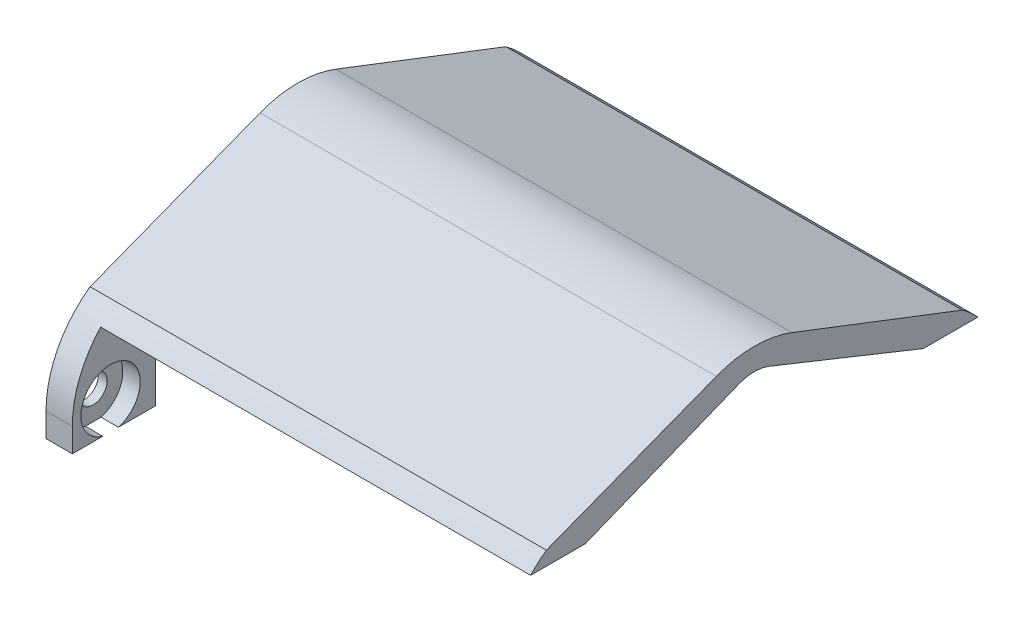
ISO-10303-21;
HEADER;
FILE_DESCRIPTION(('STEP AP214'),'2;1');
FILE_NAME('part.step','',(''),(''),'','','');
FILE_SCHEMA(('AUTOMOTIVE_DESIGN { 1 0 10303 214 1 1 1 1 }'));
ENDSEC;
DATA;
#1=APPLICATION_CONTEXT('core data for automotive mechanical design processes');
#2=APPLICATION_PROTOCOL_DEFINITION('international standard','automotive_design',2000,#1);
#3=PRODUCT_CONTEXT('',#1,'mechanical');
#4=PRODUCT('Part','Part','',(#3));
#5=PRODUCT_RELATED_PRODUCT_CATEGORY('part','',(#4));
#6=PRODUCT_DEFINITION_FORMATION('','',#4);
#7=PRODUCT_DEFINITION_CONTEXT('part definition',#1,'design');
#8=PRODUCT_DEFINITION('design','',#6,#7);
#9=PRODUCT_DEFINITION_SHAPE('','',#8);
#10=(LENGTH_UNIT() NAMED_UNIT(*) SI_UNIT(.MILLI.,.METRE.));
#11=(NAMED_UNIT(*) PLANE_ANGLE_UNIT() SI_UNIT($,.RADIAN.));
#12=(NAMED_UNIT(*) SI_UNIT($,.STERADIAN.) SOLID_ANGLE_UNIT());
#13=UNCERTAINTY_MEASURE_WITH_UNIT(LENGTH_MEASURE(1.E-05),#10,'distance_accuracy_value','');
#14=(GEOMETRIC_REPRESENTATION_CONTEXT(3) GLOBAL_UNCERTAINTY_ASSIGNED_CONTEXT((#13)) GLOBAL_UNIT_ASSIGNED_CONTEXT((#10,
#11,#12)) REPRESENTATION_CONTEXT('',''));
#15=CARTESIAN_POINT('',(0.,0.,0.));
#16=DIRECTION('',(0.,0.,1.));
#17=DIRECTION('',(1.,0.,0.));
#18=AXIS2_PLACEMENT_3D('',#15,#16,#17);
#19=CARTESIAN_POINT('',(110.,0.,0.));
#20=DIRECTION('',(0.,0.,1.));
#21=DIRECTION('',(1.,0.,0.));
#22=AXIS2_PLACEMENT_3D('',#19,#20,#21);
#23=PLANE('',#22);
#24=DIRECTION('',(-1.,0.,0.));
#25=VECTOR('',#24,1.);
#26=CARTESIAN_POINT('',(110.,0.,0.));
#27=LINE('',#26,#25);
#28=CARTESIAN_POINT('',(6.34999999999999,0.,0.));
#29=VERTEX_POINT('',#28);
#30=CARTESIAN_POINT('',(0.,0.,0.));
#31=VERTEX_POINT('',#30);
#32=EDGE_CURVE('E241',#29,#31,#27,.T.);
#33=ORIENTED_EDGE('',*,*,#32,.F.);
#34=DIRECTION('',(0.,-1.,0.));
#35=VECTOR('',#34,1.);
#36=CARTESIAN_POINT('',(6.34999999999999,23.0488587595201,0.));
#37=LINE('',#36,#35);
#38=CARTESIAN_POINT('',(6.34999999999999,5.73152923092014,0.));
#39=VERTEX_POINT('',#38);
#40=EDGE_CURVE('E312',#39,#29,#37,.T.);
#41=ORIENTED_EDGE('',*,*,#40,.F.);
#42=DIRECTION('',(-1.,0.,0.));
#43=VECTOR('',#42,1.);
#44=CARTESIAN_POINT('',(0.,5.73152923092014,0.));
#45=LINE('',#44,#43);
#46=CARTESIAN_POINT('',(0.,5.73152923092014,0.));
#47=VERTEX_POINT('',#46);
#48=EDGE_CURVE('E223',#39,#47,#45,.T.);
#49=ORIENTED_EDGE('',*,*,#48,.T.);
#50=DIRECTION('',(0.,1.,0.));
#51=VECTOR('',#50,1.);
#52=CARTESIAN_POINT('',(0.,0.,0.));
#53=LINE('',#52,#51);
#54=EDGE_CURVE('E292',#31,#47,#53,.T.);
#55=ORIENTED_EDGE('',*,*,#54,.F.);
#56=EDGE_LOOP('',(#33,#41,#49,#55));
#57=FACE_BOUND('',#56,.T.);
#58=ADVANCED_FACE('F33',(#57),#23,.T.);
#59=CARTESIAN_POINT('',(110.,0.,0.));
#60=DIRECTION('',(0.,1.,0.));
#61=DIRECTION('',(0.,0.,1.));
#62=AXIS2_PLACEMENT_3D('',#59,#60,#61);
#63=PLANE('',#62);
#64=DIRECTION('',(0.,0.,1.));
#65=VECTOR('',#64,1.);
#66=CARTESIAN_POINT('',(2.15899999999999,0.,0.));
#67=LINE('',#66,#65);
#68=CARTESIAN_POINT('',(2.15899999999999,0.,-11.0970781813428));
#69=VERTEX_POINT('',#68);
#70=CARTESIAN_POINT('',(2.15899999999999,0.,-7.32292181865722));
#71=VERTEX_POINT('',#70);
#72=EDGE_CURVE('E41',#69,#71,#67,.T.);
#73=ORIENTED_EDGE('',*,*,#72,.T.);
#74=DIRECTION('',(1.,0.,0.));
#75=VECTOR('',#74,1.);
#76=CARTESIAN_POINT('',(6.34999999999999,0.,-7.32292181865722));
#77=LINE('',#76,#75);
#78=CARTESIAN_POINT('',(6.34999999999999,0.,-7.32292181865722));
#79=VERTEX_POINT('',#78);
#80=EDGE_CURVE('E11',#71,#79,#77,.T.);
#81=ORIENTED_EDGE('',*,*,#80,.T.);
#82=DIRECTION('',(0.,0.,-1.));
#83=VECTOR('',#82,1.);
#84=CARTESIAN_POINT('',(6.34999999999999,0.,-20.));
#85=LINE('',#84,#83);
#86=EDGE_CURVE('E295',#29,#79,#85,.T.);
#87=ORIENTED_EDGE('',*,*,#86,.F.);
#88=ORIENTED_EDGE('',*,*,#32,.T.);
#89=DIRECTION('',(0.,0.,-1.));
#90=VECTOR('',#89,1.);
#91=CARTESIAN_POINT('',(0.,0.,0.));
#92=LINE('',#91,#90);
#93=CARTESIAN_POINT('',(0.,0.,-20.));
#94=VERTEX_POINT('',#93);
#95=EDGE_CURVE('E264',#31,#94,#92,.T.);
#96=ORIENTED_EDGE('',*,*,#95,.T.);
#97=DIRECTION('',(-1.,0.,0.));
#98=VECTOR('',#97,1.);
#99=CARTESIAN_POINT('',(110.,0.,-20.));
#100=LINE('',#99,#98);
#101=CARTESIAN_POINT('',(6.34999999999999,0.,-20.));
#102=VERTEX_POINT('',#101);
#103=EDGE_CURVE('E261',#102,#94,#100,.T.);
#104=ORIENTED_EDGE('',*,*,#103,.F.);
#105=CARTESIAN_POINT('',(6.34999999999999,0.,-11.0970781813428));
#106=VERTEX_POINT('',#105);
#107=EDGE_CURVE('E311',#106,#102,#85,.T.);
#108=ORIENTED_EDGE('',*,*,#107,.F.);
#109=DIRECTION('',(1.,0.,0.));
#110=VECTOR('',#109,1.);
#111=CARTESIAN_POINT('',(6.34999999999999,0.,-11.0970781813428));
#112=LINE('',#111,#110);
#113=EDGE_CURVE('E187',#106,#69,#112,.F.);
#114=ORIENTED_EDGE('',*,*,#113,.T.);
#115=EDGE_LOOP('',(#73,#81,#87,#88,#96,#104,#108,#114));
#116=FACE_BOUND('',#115,.T.);
#117=ADVANCED_FACE('F185',(#116),#63,.F.);
#118=CARTESIAN_POINT('',(110.,0.,-20.));
#119=DIRECTION('',(0.,0.,1.));
#120=DIRECTION('',(1.,0.,0.));
#121=AXIS2_PLACEMENT_3D('',#118,#119,#120);
#122=PLANE('',#121);
#123=DIRECTION('',(0.,1.,0.));
#124=VECTOR('',#123,1.);
#125=CARTESIAN_POINT('',(6.34999999999999,0.,-20.));
#126=LINE('',#125,#124);
#127=CARTESIAN_POINT('',(6.34999999999999,23.0488587595201,-20.));
#128=VERTEX_POINT('',#127);
#129=EDGE_CURVE('E308',#102,#128,#126,.T.);
#130=ORIENTED_EDGE('',*,*,#129,.F.);
#131=ORIENTED_EDGE('',*,*,#103,.T.);
#132=DIRECTION('',(0.,1.,0.));
#133=VECTOR('',#132,1.);
#134=CARTESIAN_POINT('',(0.,0.,-20.));
#135=LINE('',#134,#133);
#136=CARTESIAN_POINT('',(0.,23.0488587595201,-20.));
#137=VERTEX_POINT('',#136);
#138=EDGE_CURVE('E268',#94,#137,#135,.T.);
#139=ORIENTED_EDGE('',*,*,#138,.T.);
#140=DIRECTION('',(-1.,0.,0.));
#141=VECTOR('',#140,1.);
#142=CARTESIAN_POINT('',(110.,23.0488587595201,-20.));
#143=LINE('',#142,#141);
#144=EDGE_CURVE('E257',#128,#137,#143,.T.);
#145=ORIENTED_EDGE('',*,*,#144,.F.);
#146=EDGE_LOOP('',(#130,#131,#139,#145));
#147=FACE_BOUND('',#146,.T.);
#148=ADVANCED_FACE('F365',(#147),#122,.F.);
#149=CARTESIAN_POINT('',(110.,23.0488587595201,-20.));
#150=DIRECTION('',(0.,0.928334047087366,0.371747087437673));
#151=DIRECTION('',(0.,-0.371747087437673,0.928334047087366));
#152=AXIS2_PLACEMENT_3D('',#149,#150,#151);
#153=PLANE('',#152);
#154=DIRECTION('',(0.,0.371747087437673,-0.928334047087366));
#155=VECTOR('',#154,1.);
#156=CARTESIAN_POINT('',(0.,23.0488587595201,-20.));
#157=LINE('',#156,#155);
#158=CARTESIAN_POINT('',(0.,37.8775437443954,-57.0304801575639));
#159=VERTEX_POINT('',#158);
#160=EDGE_CURVE('E271',#137,#159,#157,.T.);
#161=ORIENTED_EDGE('',*,*,#160,.T.);
#162=DIRECTION('',(-1.,0.,0.));
#163=VECTOR('',#162,1.);
#164=CARTESIAN_POINT('',(110.,37.8775437443954,-57.0304801575639));
#165=LINE('',#164,#163);
#166=CARTESIAN_POINT('',(110.,37.8775437443954,-57.0304801575639));
#167=VERTEX_POINT('',#166);
#168=EDGE_CURVE('E213',#159,#167,#165,.F.);
#169=ORIENTED_EDGE('',*,*,#168,.T.);
#170=DIRECTION('',(0.,0.371747087437673,-0.928334047087366));
#171=VECTOR('',#170,1.);
#172=CARTESIAN_POINT('',(110.,23.0488587595201,-20.));
#173=LINE('',#172,#171);
#174=CARTESIAN_POINT('',(110.,23.0488587595201,-20.));
#175=VERTEX_POINT('',#174);
#176=EDGE_CURVE('E246',#175,#167,#173,.T.);
#177=ORIENTED_EDGE('',*,*,#176,.F.);
#178=EDGE_CURVE('E258',#175,#128,#143,.T.);
#179=ORIENTED_EDGE('',*,*,#178,.T.);
#180=ORIENTED_EDGE('',*,*,#144,.T.);
#181=EDGE_LOOP('',(#161,#169,#177,#179,#180));
#182=FACE_BOUND('',#181,.T.);
#183=ADVANCED_FACE('F407',(#182),#153,.F.);
#184=CARTESIAN_POINT('',(110.,23.0488587595201,-101.495902063881));
#185=DIRECTION('',(0.,-0.928334047087366,0.371747087437673));
#186=DIRECTION('',(0.,-0.371747087437673,-0.928334047087366));
#187=AXIS2_PLACEMENT_3D('',#184,#185,#186);
#188=PLANE('',#187);
#189=DIRECTION('',(0.,0.371747087437673,0.928334047087366));
#190=VECTOR('',#189,1.);
#191=CARTESIAN_POINT('',(110.,23.0488587595201,-101.495902063881));
#192=LINE('',#191,#190);
#193=CARTESIAN_POINT('',(110.,23.0488587595201,-101.495902063881));
#194=VERTEX_POINT('',#193);
#195=CARTESIAN_POINT('',(110.,37.8775437443954,-64.4654219063173));
#196=VERTEX_POINT('',#195);
#197=EDGE_CURVE('E298',#194,#196,#192,.T.);
#198=ORIENTED_EDGE('',*,*,#197,.T.);
#199=DIRECTION('',(-1.,0.,0.));
#200=VECTOR('',#199,1.);
#201=CARTESIAN_POINT('',(110.,37.8775437443954,-64.4654219063173));
#202=LINE('',#201,#200);
#203=CARTESIAN_POINT('',(0.,37.8775437443954,-64.4654219063173));
#204=VERTEX_POINT('',#203);
#205=EDGE_CURVE('E215',#196,#204,#202,.T.);
#206=ORIENTED_EDGE('',*,*,#205,.T.);
#207=DIRECTION('',(0.,0.371747087437673,0.928334047087366));
#208=VECTOR('',#207,1.);
#209=CARTESIAN_POINT('',(0.,23.0488587595201,-101.495902063881));
#210=LINE('',#209,#208);
#211=CARTESIAN_POINT('',(0.,23.0488587595201,-101.495902063881));
#212=VERTEX_POINT('',#211);
#213=EDGE_CURVE('E274',#212,#204,#210,.T.);
#214=ORIENTED_EDGE('',*,*,#213,.F.);
#215=DIRECTION('',(-1.,0.,0.));
#216=VECTOR('',#215,1.);
#217=CARTESIAN_POINT('',(110.,23.0488587595201,-101.495902063881));
#218=LINE('',#217,#216);
#219=CARTESIAN_POINT('',(6.34999999999999,23.0488587595201,-101.495902063881));
#220=VERTEX_POINT('',#219);
#221=EDGE_CURVE('E253',#220,#212,#218,.T.);
#222=ORIENTED_EDGE('',*,*,#221,.F.);
#223=EDGE_CURVE('E254',#194,#220,#218,.T.);
#224=ORIENTED_EDGE('',*,*,#223,.F.);
#225=EDGE_LOOP('',(#198,#206,#214,#222,#224));
#226=FACE_BOUND('',#225,.T.);
#227=ADVANCED_FACE('F414',(#226),#188,.T.);
#228=CARTESIAN_POINT('',(110.,23.0488587595201,-101.495902063881));
#229=DIRECTION('',(0.,0.,-1.));
#230=DIRECTION('',(-1.,0.,0.));
#231=AXIS2_PLACEMENT_3D('',#228,#229,#230);
#232=PLANE('',#231);
#233=DIRECTION('',(-1.,0.,0.));
#234=VECTOR('',#233,1.);
#235=CARTESIAN_POINT('',(110.,0.,-101.495902063881));
#236=LINE('',#235,#234);
#237=CARTESIAN_POINT('',(6.34999999999999,0.,-101.495902063881));
#238=VERTEX_POINT('',#237);
#239=CARTESIAN_POINT('',(0.,0.,-101.495902063881));
#240=VERTEX_POINT('',#239);
#241=EDGE_CURVE('E251',#238,#240,#236,.T.);
#242=ORIENTED_EDGE('',*,*,#241,.F.);
#243=DIRECTION('',(0.,-1.,0.));
#244=VECTOR('',#243,1.);
#245=CARTESIAN_POINT('',(6.34999999999999,0.,-101.495902063881));
#246=LINE('',#245,#244);
#247=EDGE_CURVE('E320',#220,#238,#246,.T.);
#248=ORIENTED_EDGE('',*,*,#247,.F.);
#249=ORIENTED_EDGE('',*,*,#221,.T.);
#250=DIRECTION('',(0.,-1.,0.));
#251=VECTOR('',#250,1.);
#252=CARTESIAN_POINT('',(0.,23.0488587595201,-101.495902063881));
#253=LINE('',#252,#251);
#254=EDGE_CURVE('E277',#212,#240,#253,.T.);
#255=ORIENTED_EDGE('',*,*,#254,.T.);
#256=EDGE_LOOP('',(#242,#248,#249,#255));
#257=FACE_BOUND('',#256,.T.);
#258=ADVANCED_FACE('F424',(#257),#232,.F.);
#259=CARTESIAN_POINT('',(110.,0.,-101.495902063881));
#260=DIRECTION('',(0.,1.,0.));
#261=DIRECTION('',(0.,0.,1.));
#262=AXIS2_PLACEMENT_3D('',#259,#260,#261);
#263=PLANE('',#262);
#264=DIRECTION('',(0.,0.,1.));
#265=VECTOR('',#264,1.);
#266=CARTESIAN_POINT('',(2.15899999999999,0.,-101.495902063881));
#267=LINE('',#266,#265);
#268=CARTESIAN_POINT('',(2.15899999999999,0.,-114.172980245224));
#269=VERTEX_POINT('',#268);
#270=CARTESIAN_POINT('',(2.15899999999999,0.,-110.398823882538));
#271=VERTEX_POINT('',#270);
#272=EDGE_CURVE('E193',#269,#271,#267,.T.);
#273=ORIENTED_EDGE('',*,*,#272,.T.);
#274=DIRECTION('',(1.,0.,0.));
#275=VECTOR('',#274,1.);
#276=CARTESIAN_POINT('',(6.34999999999999,0.,-110.398823882538));
#277=LINE('',#276,#275);
#278=CARTESIAN_POINT('',(6.34999999999999,0.,-110.398823882538));
#279=VERTEX_POINT('',#278);
#280=EDGE_CURVE('E188',#271,#279,#277,.T.);
#281=ORIENTED_EDGE('',*,*,#280,.T.);
#282=DIRECTION('',(0.,0.,-1.));
#283=VECTOR('',#282,1.);
#284=CARTESIAN_POINT('',(6.34999999999999,0.,-121.495902063881));
#285=LINE('',#284,#283);
#286=EDGE_CURVE('E325',#238,#279,#285,.T.);
#287=ORIENTED_EDGE('',*,*,#286,.F.);
#288=ORIENTED_EDGE('',*,*,#241,.T.);
#289=DIRECTION('',(0.,0.,-1.));
#290=VECTOR('',#289,1.);
#291=CARTESIAN_POINT('',(0.,0.,-101.495902063881));
#292=LINE('',#291,#290);
#293=CARTESIAN_POINT('',(0.,0.,-121.495902063881));
#294=VERTEX_POINT('',#293);
#295=EDGE_CURVE('E280',#240,#294,#292,.T.);
#296=ORIENTED_EDGE('',*,*,#295,.T.);
#297=DIRECTION('',(-1.,0.,0.));
#298=VECTOR('',#297,1.);
#299=CARTESIAN_POINT('',(110.,0.,-121.495902063881));
#300=LINE('',#299,#298);
#301=CARTESIAN_POINT('',(6.34999999999999,0.,-121.495902063881));
#302=VERTEX_POINT('',#301);
#303=EDGE_CURVE('E249',#302,#294,#300,.T.);
#304=ORIENTED_EDGE('',*,*,#303,.F.);
#305=CARTESIAN_POINT('',(6.34999999999999,0.,-114.172980245224));
#306=VERTEX_POINT('',#305);
#307=EDGE_CURVE('E328',#306,#302,#285,.T.);
#308=ORIENTED_EDGE('',*,*,#307,.F.);
#309=DIRECTION('',(1.,0.,0.));
#310=VECTOR('',#309,1.);
#311=CARTESIAN_POINT('',(6.34999999999999,0.,-114.172980245224));
#312=LINE('',#311,#310);
#313=EDGE_CURVE('E196',#306,#269,#312,.F.);
#314=ORIENTED_EDGE('',*,*,#313,.T.);
#315=EDGE_LOOP('',(#273,#281,#287,#288,#296,#304,#308,#314));
#316=FACE_BOUND('',#315,.T.);
#317=ADVANCED_FACE('F431',(#316),#263,.F.);
#318=CARTESIAN_POINT('',(110.,0.,-121.495902063881));
#319=DIRECTION('',(0.,0.,1.));
#320=DIRECTION('',(1.,0.,0.));
#321=AXIS2_PLACEMENT_3D('',#318,#319,#320);
#322=PLANE('',#321);
#323=DIRECTION('',(-1.,0.,0.));
#324=VECTOR('',#323,1.);
#325=CARTESIAN_POINT('',(110.,5.73152923092011,-121.495902063881));
#326=LINE('',#325,#324);
#327=CARTESIAN_POINT('',(0.,5.7315292309201,-121.495902063881));
#328=VERTEX_POINT('',#327);
#329=CARTESIAN_POINT('',(6.34999999999999,5.73152923092011,-121.495902063881));
#330=VERTEX_POINT('',#329);
#331=EDGE_CURVE('E232',#328,#330,#326,.F.);
#332=ORIENTED_EDGE('',*,*,#331,.T.);
#333=DIRECTION('',(0.,1.,0.));
#334=VECTOR('',#333,1.);
#335=CARTESIAN_POINT('',(6.34999999999999,23.0488587595201,-121.495902063881));
#336=LINE('',#335,#334);
#337=EDGE_CURVE('E323',#302,#330,#336,.T.);
#338=ORIENTED_EDGE('',*,*,#337,.F.);
#339=ORIENTED_EDGE('',*,*,#303,.T.);
#340=DIRECTION('',(0.,1.,0.));
#341=VECTOR('',#340,1.);
#342=CARTESIAN_POINT('',(0.,0.,-121.495902063881));
#343=LINE('',#342,#341);
#344=EDGE_CURVE('E283',#294,#328,#343,.T.);
#345=ORIENTED_EDGE('',*,*,#344,.T.);
#346=EDGE_LOOP('',(#332,#338,#339,#345));
#347=FACE_BOUND('',#346,.T.);
#348=ADVANCED_FACE('F439',(#347),#322,.F.);
#349=CARTESIAN_POINT('',(110.,26.3956793465189,-110.865902063881));
#350=DIRECTION('',(0.,-0.933068535772419,0.359698634347581));
#351=DIRECTION('',(0.,-0.359698634347581,-0.933068535772419));
#352=AXIS2_PLACEMENT_3D('',#349,#350,#351);
#353=PLANE('',#352);
#354=DIRECTION('',(0.,0.359698634347581,0.933068535772419));
#355=VECTOR('',#354,1.);
#356=CARTESIAN_POINT('',(0.,26.3956793465189,-110.865902063881));
#357=LINE('',#356,#355);
#358=CARTESIAN_POINT('',(0.,26.3956793465189,-110.865902063881));
#359=VERTEX_POINT('',#358);
#360=CARTESIAN_POINT('',(0.,42.1941197027533,-69.8842963443692));
#361=VERTEX_POINT('',#360);
#362=EDGE_CURVE('E286',#359,#361,#357,.T.);
#363=ORIENTED_EDGE('',*,*,#362,.T.);
#364=DIRECTION('',(-1.,0.,0.));
#365=VECTOR('',#364,1.);
#366=CARTESIAN_POINT('',(110.,42.1941197027533,-69.8842963443692));
#367=LINE('',#366,#365);
#368=CARTESIAN_POINT('',(110.,42.1941197027533,-69.8842963443692));
#369=VERTEX_POINT('',#368);
#370=EDGE_CURVE('E218',#361,#369,#367,.F.);
#371=ORIENTED_EDGE('',*,*,#370,.T.);
#372=DIRECTION('',(0.,0.359698634347581,0.933068535772419));
#373=VECTOR('',#372,1.);
#374=CARTESIAN_POINT('',(110.,26.3956793465189,-110.865902063881));
#375=LINE('',#374,#373);
#376=CARTESIAN_POINT('',(110.,26.3956793465189,-110.865902063881));
#377=VERTEX_POINT('',#376);
#378=EDGE_CURVE('E301',#377,#369,#375,.T.);
#379=ORIENTED_EDGE('',*,*,#378,.F.);
#380=DIRECTION('',(-1.,0.,0.));
#381=VECTOR('',#380,1.);
#382=CARTESIAN_POINT('',(110.,26.3956793465189,-110.865902063881));
#383=LINE('',#382,#381);
#384=EDGE_CURVE('E245',#377,#359,#383,.T.);
#385=ORIENTED_EDGE('',*,*,#384,.T.);
#386=EDGE_LOOP('',(#363,#371,#379,#385));
#387=FACE_BOUND('',#386,.T.);
#388=ADVANCED_FACE('F448',(#387),#353,.F.);
#389=CARTESIAN_POINT('',(110.,26.3956793465189,-10.63));
#390=DIRECTION('',(0.,0.933068535772419,0.359698634347581));
#391=DIRECTION('',(0.,-0.359698634347581,0.933068535772419));
#392=AXIS2_PLACEMENT_3D('',#389,#390,#391);
#393=PLANE('',#392);
#394=DIRECTION('',(0.,0.359698634347581,-0.933068535772419));
#395=VECTOR('',#394,1.);
#396=CARTESIAN_POINT('',(110.,26.3956793465189,-10.63));
#397=LINE('',#396,#395);
#398=CARTESIAN_POINT('',(110.,26.3956793465189,-10.63));
#399=VERTEX_POINT('',#398);
#400=CARTESIAN_POINT('',(110.,42.1941197027533,-51.611605719512));
#401=VERTEX_POINT('',#400);
#402=EDGE_CURVE('E267',#399,#401,#397,.T.);
#403=ORIENTED_EDGE('',*,*,#402,.T.);
#404=DIRECTION('',(-1.,0.,0.));
#405=VECTOR('',#404,1.);
#406=CARTESIAN_POINT('',(0.,42.1941197027533,-51.611605719512));
#407=LINE('',#406,#405);
#408=CARTESIAN_POINT('',(0.,42.1941197027533,-51.611605719512));
#409=VERTEX_POINT('',#408);
#410=EDGE_CURVE('E220',#401,#409,#407,.T.);
#411=ORIENTED_EDGE('',*,*,#410,.T.);
#412=DIRECTION('',(0.,0.359698634347581,-0.933068535772419));
#413=VECTOR('',#412,1.);
#414=CARTESIAN_POINT('',(0.,26.3956793465189,-10.63));
#415=LINE('',#414,#413);
#416=CARTESIAN_POINT('',(0.,26.3956793465189,-10.63));
#417=VERTEX_POINT('',#416);
#418=EDGE_CURVE('E289',#417,#409,#415,.T.);
#419=ORIENTED_EDGE('',*,*,#418,.F.);
#420=DIRECTION('',(-1.,0.,0.));
#421=VECTOR('',#420,1.);
#422=CARTESIAN_POINT('',(110.,26.3956793465189,-10.63));
#423=LINE('',#422,#421);
#424=EDGE_CURVE('E242',#399,#417,#423,.T.);
#425=ORIENTED_EDGE('',*,*,#424,.F.);
#426=EDGE_LOOP('',(#403,#411,#419,#425));
#427=FACE_BOUND('',#426,.T.);
#428=ADVANCED_FACE('F370',(#427),#393,.T.);
#429=CARTESIAN_POINT('',(110.,0.,0.));
#430=DIRECTION('',(-1.,0.,0.));
#431=DIRECTION('',(0.,0.,1.));
#432=AXIS2_PLACEMENT_3D('',#429,#430,#431);
#433=PLANE('',#432);
#434=ORIENTED_EDGE('',*,*,#197,.F.);
#435=DIRECTION('',(0.,0.,1.));
#436=VECTOR('',#435,1.);
#437=CARTESIAN_POINT('',(110.,23.0488587595201,-101.495902063881));
#438=LINE('',#437,#436);
#439=CARTESIAN_POINT('',(110.,23.0488587595201,-114.677347056074));
#440=VERTEX_POINT('',#439);
#441=EDGE_CURVE('E318',#440,#194,#438,.T.);
#442=ORIENTED_EDGE('',*,*,#441,.F.);
#443=CARTESIAN_POINT('',(110.,5.73152923092011,-96.0959020638812));
#444=DIRECTION('',(-1.,0.,0.));
#445=DIRECTION('',(0.,0.,1.));
#446=AXIS2_PLACEMENT_3D('',#443,#444,#445);
#447=CIRCLE('',#446,25.4);
#448=EDGE_CURVE('E225',#440,#377,#447,.F.);
#449=ORIENTED_EDGE('',*,*,#448,.T.);
#450=ORIENTED_EDGE('',*,*,#378,.T.);
#451=CARTESIAN_POINT('',(110.,18.4941788941338,-60.7479510319406));
#452=DIRECTION('',(-1.,0.,0.));
#453=DIRECTION('',(0.,0.,1.));
#454=AXIS2_PLACEMENT_3D('',#451,#452,#453);
#455=CIRCLE('',#454,25.4);
#456=EDGE_CURVE('E230',#369,#401,#455,.F.);
#457=ORIENTED_EDGE('',*,*,#456,.T.);
#458=ORIENTED_EDGE('',*,*,#402,.F.);
#459=CARTESIAN_POINT('',(110.,5.73152923092014,-25.4));
#460=DIRECTION('',(-1.,0.,0.));
#461=DIRECTION('',(0.,0.,1.));
#462=AXIS2_PLACEMENT_3D('',#459,#460,#461);
#463=CIRCLE('',#462,25.4);
#464=CARTESIAN_POINT('',(110.,23.0488587595201,-6.81855500780738));
#465=VERTEX_POINT('',#464);
#466=EDGE_CURVE('E227',#399,#465,#463,.F.);
#467=ORIENTED_EDGE('',*,*,#466,.T.);
#468=DIRECTION('',(0.,0.,1.));
#469=VECTOR('',#468,1.);
#470=CARTESIAN_POINT('',(110.,23.0488587595201,-20.));
#471=LINE('',#470,#469);
#472=EDGE_CURVE('E306',#175,#465,#471,.T.);
#473=ORIENTED_EDGE('',*,*,#472,.F.);
#474=ORIENTED_EDGE('',*,*,#176,.T.);
#475=CARTESIAN_POINT('',(110.,28.5942032735217,-60.7479510319406));
#476=DIRECTION('',(-1.,0.,0.));
#477=DIRECTION('',(0.,0.,1.));
#478=AXIS2_PLACEMENT_3D('',#475,#476,#477);
#479=CIRCLE('',#478,10.);
#480=EDGE_CURVE('E209',#167,#196,#479,.T.);
#481=ORIENTED_EDGE('',*,*,#480,.T.);
#482=EDGE_LOOP('',(#434,#442,#449,#450,#457,#458,#467,#473,#474,#481));
#483=FACE_BOUND('',#482,.T.);
#484=ADVANCED_FACE('F394',(#483),#433,.F.);
#485=CARTESIAN_POINT('',(0.,0.,0.));
#486=DIRECTION('',(-1.,0.,0.));
#487=DIRECTION('',(0.,0.,1.));
#488=AXIS2_PLACEMENT_3D('',#485,#486,#487);
#489=PLANE('',#488);
#490=CARTESIAN_POINT('',(0.,6.89,-9.21));
#491=DIRECTION('',(1.,0.,0.));
#492=DIRECTION('',(0.,0.,-1.));
#493=AXIS2_PLACEMENT_3D('',#490,#491,#492);
#494=CIRCLE('',#493,3.3782);
#495=CARTESIAN_POINT('',(0.,6.89,-12.5882));
#496=VERTEX_POINT('',#495);
#497=EDGE_CURVE('E338',#496,#496,#494,.T.);
#498=ORIENTED_EDGE('',*,*,#497,.T.);
#499=EDGE_LOOP('',(#498));
#500=FACE_BOUND('',#499,.T.);
#501=CARTESIAN_POINT('',(0.,6.89,-112.285902063881));
#502=DIRECTION('',(1.,0.,0.));
#503=DIRECTION('',(0.,0.,-1.));
#504=AXIS2_PLACEMENT_3D('',#501,#502,#503);
#505=CIRCLE('',#504,3.3782);
#506=CARTESIAN_POINT('',(0.,6.89,-115.664102063881));
#507=VERTEX_POINT('',#506);
#508=EDGE_CURVE('E321',#507,#507,#505,.T.);
#509=ORIENTED_EDGE('',*,*,#508,.T.);
#510=EDGE_LOOP('',(#509));
#511=FACE_BOUND('',#510,.T.);
#512=ORIENTED_EDGE('',*,*,#362,.F.);
#513=CARTESIAN_POINT('',(0.,5.73152923092011,-96.0959020638812));
#514=DIRECTION('',(-1.,0.,0.));
#515=DIRECTION('',(0.,0.,1.));
#516=AXIS2_PLACEMENT_3D('',#513,#514,#515);
#517=CIRCLE('',#516,25.4);
#518=EDGE_CURVE('E235',#359,#328,#517,.T.);
#519=ORIENTED_EDGE('',*,*,#518,.T.);
#520=ORIENTED_EDGE('',*,*,#344,.F.);
#521=ORIENTED_EDGE('',*,*,#295,.F.);
#522=ORIENTED_EDGE('',*,*,#254,.F.);
#523=ORIENTED_EDGE('',*,*,#213,.T.);
#524=CARTESIAN_POINT('',(0.,28.5942032735217,-60.7479510319406));
#525=DIRECTION('',(-1.,0.,0.));
#526=DIRECTION('',(0.,0.,1.));
#527=AXIS2_PLACEMENT_3D('',#524,#525,#526);
#528=CIRCLE('',#527,10.);
#529=EDGE_CURVE('E211',#204,#159,#528,.F.);
#530=ORIENTED_EDGE('',*,*,#529,.T.);
#531=ORIENTED_EDGE('',*,*,#160,.F.);
#532=ORIENTED_EDGE('',*,*,#138,.F.);
#533=ORIENTED_EDGE('',*,*,#95,.F.);
#534=ORIENTED_EDGE('',*,*,#54,.T.);
#535=CARTESIAN_POINT('',(0.,5.73152923092014,-25.4));
#536=DIRECTION('',(-1.,0.,0.));
#537=DIRECTION('',(0.,0.,1.));
#538=AXIS2_PLACEMENT_3D('',#535,#536,#537);
#539=CIRCLE('',#538,25.4);
#540=EDGE_CURVE('E237',#47,#417,#539,.T.);
#541=ORIENTED_EDGE('',*,*,#540,.T.);
#542=ORIENTED_EDGE('',*,*,#418,.T.);
#543=CARTESIAN_POINT('',(0.,18.4941788941338,-60.7479510319406));
#544=DIRECTION('',(-1.,0.,0.));
#545=DIRECTION('',(0.,0.,1.));
#546=AXIS2_PLACEMENT_3D('',#543,#544,#545);
#547=CIRCLE('',#546,25.4);
#548=EDGE_CURVE('E239',#409,#361,#547,.T.);
#549=ORIENTED_EDGE('',*,*,#548,.T.);
#550=EDGE_LOOP('',(#512,#519,#520,#521,#522,#523,#530,#531,#532,#533,#534,#541,#542,#549));
#551=FACE_BOUND('',#550,.T.);
#552=ADVANCED_FACE('F376',(#500,#511,#551),#489,.T.);
#553=CARTESIAN_POINT('',(110.,5.73152923092011,-96.0959020638812));
#554=DIRECTION('',(-1.,0.,0.));
#555=DIRECTION('',(0.,0.,1.));
#556=AXIS2_PLACEMENT_3D('',#553,#554,#555);
#557=CYLINDRICAL_SURFACE('',#556,25.4);
#558=DIRECTION('',(-1.,0.,0.));
#559=VECTOR('',#558,1.);
#560=CARTESIAN_POINT('',(110.,23.0488587595201,-114.677347056074));
#561=LINE('',#560,#559);
#562=CARTESIAN_POINT('',(6.34999999999999,23.0488587595201,-114.677347056074));
#563=VERTEX_POINT('',#562);
#564=EDGE_CURVE('E199',#563,#440,#561,.F.);
#565=ORIENTED_EDGE('',*,*,#564,.F.);
#566=CARTESIAN_POINT('',(6.34999999999999,5.73152923092011,-96.0959020638812));
#567=DIRECTION('',(-1.,0.,0.));
#568=DIRECTION('',(0.,0.,1.));
#569=AXIS2_PLACEMENT_3D('',#566,#567,#568);
#570=CIRCLE('',#569,25.4);
#571=EDGE_CURVE('E201',#330,#563,#570,.F.);
#572=ORIENTED_EDGE('',*,*,#571,.F.);
#573=ORIENTED_EDGE('',*,*,#331,.F.);
#574=ORIENTED_EDGE('',*,*,#518,.F.);
#575=ORIENTED_EDGE('',*,*,#384,.F.);
#576=ORIENTED_EDGE('',*,*,#448,.F.);
#577=EDGE_LOOP('',(#565,#572,#573,#574,#575,#576));
#578=FACE_BOUND('',#577,.T.);
#579=ADVANCED_FACE('F372',(#578),#557,.T.);
#580=CARTESIAN_POINT('',(110.,5.73152923092014,-25.4));
#581=DIRECTION('',(1.,0.,0.));
#582=DIRECTION('',(0.,0.,-1.));
#583=AXIS2_PLACEMENT_3D('',#580,#581,#582);
#584=CYLINDRICAL_SURFACE('',#583,25.4);
#585=DIRECTION('',(1.,0.,0.));
#586=VECTOR('',#585,1.);
#587=CARTESIAN_POINT('',(110.,23.0488587595201,-6.81855500780738));
#588=LINE('',#587,#586);
#589=CARTESIAN_POINT('',(6.34999999999999,23.0488587595201,-6.81855500780738));
#590=VERTEX_POINT('',#589);
#591=EDGE_CURVE('E203',#465,#590,#588,.F.);
#592=ORIENTED_EDGE('',*,*,#591,.F.);
#593=ORIENTED_EDGE('',*,*,#466,.F.);
#594=ORIENTED_EDGE('',*,*,#424,.T.);
#595=ORIENTED_EDGE('',*,*,#540,.F.);
#596=ORIENTED_EDGE('',*,*,#48,.F.);
#597=CARTESIAN_POINT('',(6.34999999999999,5.73152923092014,-25.4));
#598=DIRECTION('',(1.,0.,0.));
#599=DIRECTION('',(0.,0.,-1.));
#600=AXIS2_PLACEMENT_3D('',#597,#598,#599);
#601=CIRCLE('',#600,25.4);
#602=EDGE_CURVE('E206',#39,#590,#601,.F.);
#603=ORIENTED_EDGE('',*,*,#602,.T.);
#604=EDGE_LOOP('',(#592,#593,#594,#595,#596,#603));
#605=FACE_BOUND('',#604,.T.);
#606=ADVANCED_FACE('F375',(#605),#584,.T.);
#607=CARTESIAN_POINT('',(110.,18.4941788941338,-60.7479510319406));
#608=DIRECTION('',(1.,0.,0.));
#609=DIRECTION('',(0.,0.,-1.));
#610=AXIS2_PLACEMENT_3D('',#607,#608,#609);
#611=CYLINDRICAL_SURFACE('',#610,25.4);
#612=ORIENTED_EDGE('',*,*,#456,.F.);
#613=ORIENTED_EDGE('',*,*,#370,.F.);
#614=ORIENTED_EDGE('',*,*,#548,.F.);
#615=ORIENTED_EDGE('',*,*,#410,.F.);
#616=EDGE_LOOP('',(#612,#613,#614,#615));
#617=FACE_BOUND('',#616,.T.);
#618=ADVANCED_FACE('F379',(#617),#611,.T.);
#619=CARTESIAN_POINT('',(110.,28.5942032735217,-60.7479510319406));
#620=DIRECTION('',(-1.,0.,0.));
#621=DIRECTION('',(0.,0.,1.));
#622=AXIS2_PLACEMENT_3D('',#619,#620,#621);
#623=CYLINDRICAL_SURFACE('',#622,10.);
#624=ORIENTED_EDGE('',*,*,#480,.F.);
#625=ORIENTED_EDGE('',*,*,#168,.F.);
#626=ORIENTED_EDGE('',*,*,#529,.F.);
#627=ORIENTED_EDGE('',*,*,#205,.F.);
#628=EDGE_LOOP('',(#624,#625,#626,#627));
#629=FACE_BOUND('',#628,.T.);
#630=ADVANCED_FACE('F35',(#629),#623,.F.);
#631=CARTESIAN_POINT('',(6.34999999999999,23.0488587595201,-20.));
#632=DIRECTION('',(0.,1.,0.));
#633=DIRECTION('',(0.,0.,1.));
#634=AXIS2_PLACEMENT_3D('',#631,#632,#633);
#635=PLANE('',#634);
#636=ORIENTED_EDGE('',*,*,#591,.T.);
#637=DIRECTION('',(0.,0.,1.));
#638=VECTOR('',#637,1.);
#639=CARTESIAN_POINT('',(6.34999999999999,23.0488587595201,-20.));
#640=LINE('',#639,#638);
#641=EDGE_CURVE('E314',#128,#590,#640,.T.);
#642=ORIENTED_EDGE('',*,*,#641,.F.);
#643=ORIENTED_EDGE('',*,*,#178,.F.);
#644=ORIENTED_EDGE('',*,*,#472,.T.);
#645=EDGE_LOOP('',(#636,#642,#643,#644));
#646=FACE_BOUND('',#645,.T.);
#647=ADVANCED_FACE('F386',(#646),#635,.F.);
#648=CARTESIAN_POINT('',(6.34999999999999,0.,0.));
#649=DIRECTION('',(1.,0.,0.));
#650=DIRECTION('',(0.,0.,-1.));
#651=AXIS2_PLACEMENT_3D('',#648,#649,#650);
#652=PLANE('',#651);
#653=CARTESIAN_POINT('',(6.34999999999999,6.89,-9.21));
#654=DIRECTION('',(1.,0.,0.));
#655=DIRECTION('',(0.,0.,-1.));
#656=AXIS2_PLACEMENT_3D('',#653,#654,#655);
#657=CIRCLE('',#656,7.14374999999999);
#658=EDGE_CURVE('E175',#106,#79,#657,.T.);
#659=ORIENTED_EDGE('',*,*,#658,.F.);
#660=ORIENTED_EDGE('',*,*,#107,.T.);
#661=ORIENTED_EDGE('',*,*,#129,.T.);
#662=ORIENTED_EDGE('',*,*,#641,.T.);
#663=ORIENTED_EDGE('',*,*,#602,.F.);
#664=ORIENTED_EDGE('',*,*,#40,.T.);
#665=ORIENTED_EDGE('',*,*,#86,.T.);
#666=EDGE_LOOP('',(#659,#660,#661,#662,#663,#664,#665));
#667=FACE_BOUND('',#666,.T.);
#668=ADVANCED_FACE('F454',(#667),#652,.T.);
#669=CARTESIAN_POINT('',(6.34999999999999,23.0488587595201,-101.495902063881));
#670=DIRECTION('',(0.,1.,0.));
#671=DIRECTION('',(0.,0.,1.));
#672=AXIS2_PLACEMENT_3D('',#669,#670,#671);
#673=PLANE('',#672);
#674=ORIENTED_EDGE('',*,*,#564,.T.);
#675=ORIENTED_EDGE('',*,*,#441,.T.);
#676=ORIENTED_EDGE('',*,*,#223,.T.);
#677=DIRECTION('',(0.,0.,1.));
#678=VECTOR('',#677,1.);
#679=CARTESIAN_POINT('',(6.34999999999999,23.0488587595201,-101.495902063881));
#680=LINE('',#679,#678);
#681=EDGE_CURVE('E309',#563,#220,#680,.T.);
#682=ORIENTED_EDGE('',*,*,#681,.F.);
#683=EDGE_LOOP('',(#674,#675,#676,#682));
#684=FACE_BOUND('',#683,.T.);
#685=ADVANCED_FACE('F420',(#684),#673,.F.);
#686=CARTESIAN_POINT('',(6.34999999999999,0.,0.));
#687=DIRECTION('',(-1.,0.,0.));
#688=DIRECTION('',(0.,0.,1.));
#689=AXIS2_PLACEMENT_3D('',#686,#687,#688);
#690=PLANE('',#689);
#691=ORIENTED_EDGE('',*,*,#286,.T.);
#692=CARTESIAN_POINT('',(6.34999999999999,6.89,-112.285902063881));
#693=DIRECTION('',(1.,0.,0.));
#694=DIRECTION('',(0.,0.,-1.));
#695=AXIS2_PLACEMENT_3D('',#692,#693,#694);
#696=CIRCLE('',#695,7.14374999999999);
#697=EDGE_CURVE('E336',#306,#279,#696,.T.);
#698=ORIENTED_EDGE('',*,*,#697,.F.);
#699=ORIENTED_EDGE('',*,*,#307,.T.);
#700=ORIENTED_EDGE('',*,*,#337,.T.);
#701=ORIENTED_EDGE('',*,*,#571,.T.);
#702=ORIENTED_EDGE('',*,*,#681,.T.);
#703=ORIENTED_EDGE('',*,*,#247,.T.);
#704=EDGE_LOOP('',(#691,#698,#699,#700,#701,#702,#703));
#705=FACE_BOUND('',#704,.T.);
#706=ADVANCED_FACE('F428',(#705),#690,.F.);
#707=CARTESIAN_POINT('',(2.15899999999999,10.2682,-112.285902063881));
#708=DIRECTION('',(-1.,0.,0.));
#709=DIRECTION('',(0.,0.,1.));
#710=AXIS2_PLACEMENT_3D('',#707,#708,#709);
#711=PLANE('',#710);
#712=CARTESIAN_POINT('',(2.15899999999999,6.89,-112.285902063881));
#713=DIRECTION('',(1.,0.,0.));
#714=DIRECTION('',(0.,0.,-1.));
#715=AXIS2_PLACEMENT_3D('',#712,#713,#714);
#716=CIRCLE('',#715,3.37820000000001);
#717=CARTESIAN_POINT('',(2.15899999999999,6.89,-115.664102063881));
#718=VERTEX_POINT('',#717);
#719=EDGE_CURVE('E332',#718,#718,#716,.T.);
#720=ORIENTED_EDGE('',*,*,#719,.F.);
#721=EDGE_LOOP('',(#720));
#722=FACE_BOUND('',#721,.T.);
#723=CARTESIAN_POINT('',(2.15899999999999,6.89,-112.285902063881));
#724=DIRECTION('',(1.,0.,0.));
#725=DIRECTION('',(0.,0.,-1.));
#726=AXIS2_PLACEMENT_3D('',#723,#724,#725);
#727=CIRCLE('',#726,7.14375);
#728=EDGE_CURVE('E56',#269,#271,#727,.T.);
#729=ORIENTED_EDGE('',*,*,#728,.T.);
#730=ORIENTED_EDGE('',*,*,#272,.F.);
#731=EDGE_LOOP('',(#729,#730));
#732=FACE_BOUND('',#731,.T.);
#733=ADVANCED_FACE('F433',(#722,#732),#711,.F.);
#734=CARTESIAN_POINT('',(6.34999999999999,6.89,-112.285902063881));
#735=DIRECTION('',(1.,0.,0.));
#736=DIRECTION('',(0.,0.,-1.));
#737=AXIS2_PLACEMENT_3D('',#734,#735,#736);
#738=CYLINDRICAL_SURFACE('',#737,7.14375);
#739=ORIENTED_EDGE('',*,*,#728,.F.);
#740=ORIENTED_EDGE('',*,*,#313,.F.);
#741=ORIENTED_EDGE('',*,*,#697,.T.);
#742=ORIENTED_EDGE('',*,*,#280,.F.);
#743=EDGE_LOOP('',(#739,#740,#741,#742));
#744=FACE_BOUND('',#743,.T.);
#745=ADVANCED_FACE('F355',(#744),#738,.F.);
#746=CARTESIAN_POINT('',(6.34999999999999,6.89,-112.285902063881));
#747=DIRECTION('',(1.,0.,0.));
#748=DIRECTION('',(0.,0.,-1.));
#749=AXIS2_PLACEMENT_3D('',#746,#747,#748);
#750=CYLINDRICAL_SURFACE('',#749,3.37820000000001);
#751=ORIENTED_EDGE('',*,*,#508,.F.);
#752=EDGE_LOOP('',(#751));
#753=FACE_BOUND('',#752,.T.);
#754=ORIENTED_EDGE('',*,*,#719,.T.);
#755=EDGE_LOOP('',(#754));
#756=FACE_BOUND('',#755,.T.);
#757=ADVANCED_FACE('F348',(#753,#756),#750,.F.);
#758=CARTESIAN_POINT('',(2.15899999999999,10.2682,-9.21));
#759=DIRECTION('',(-1.,0.,0.));
#760=DIRECTION('',(0.,0.,1.));
#761=AXIS2_PLACEMENT_3D('',#758,#759,#760);
#762=PLANE('',#761);
#763=CARTESIAN_POINT('',(2.15899999999999,6.89,-9.21));
#764=DIRECTION('',(1.,0.,0.));
#765=DIRECTION('',(0.,0.,-1.));
#766=AXIS2_PLACEMENT_3D('',#763,#764,#765);
#767=CIRCLE('',#766,3.37820000000001);
#768=CARTESIAN_POINT('',(2.15899999999999,6.89,-12.5882));
#769=VERTEX_POINT('',#768);
#770=EDGE_CURVE('E183',#769,#769,#767,.T.);
#771=ORIENTED_EDGE('',*,*,#770,.F.);
#772=EDGE_LOOP('',(#771));
#773=FACE_BOUND('',#772,.T.);
#774=CARTESIAN_POINT('',(2.15899999999999,6.89,-9.21));
#775=DIRECTION('',(1.,0.,0.));
#776=DIRECTION('',(0.,0.,-1.));
#777=AXIS2_PLACEMENT_3D('',#774,#775,#776);
#778=CIRCLE('',#777,7.14375);
#779=EDGE_CURVE('E48',#69,#71,#778,.T.);
#780=ORIENTED_EDGE('',*,*,#779,.T.);
#781=ORIENTED_EDGE('',*,*,#72,.F.);
#782=EDGE_LOOP('',(#780,#781));
#783=FACE_BOUND('',#782,.T.);
#784=ADVANCED_FACE('F181',(#773,#783),#762,.F.);
#785=CARTESIAN_POINT('',(6.34999999999999,6.89,-9.21));
#786=DIRECTION('',(1.,0.,0.));
#787=DIRECTION('',(0.,0.,-1.));
#788=AXIS2_PLACEMENT_3D('',#785,#786,#787);
#789=CYLINDRICAL_SURFACE('',#788,7.14375);
#790=ORIENTED_EDGE('',*,*,#779,.F.);
#791=ORIENTED_EDGE('',*,*,#113,.F.);
#792=ORIENTED_EDGE('',*,*,#658,.T.);
#793=ORIENTED_EDGE('',*,*,#80,.F.);
#794=EDGE_LOOP('',(#790,#791,#792,#793));
#795=FACE_BOUND('',#794,.T.);
#796=ADVANCED_FACE('F173',(#795),#789,.F.);
#797=CARTESIAN_POINT('',(6.34999999999999,6.89,-9.21));
#798=DIRECTION('',(1.,0.,0.));
#799=DIRECTION('',(0.,0.,-1.));
#800=AXIS2_PLACEMENT_3D('',#797,#798,#799);
#801=CYLINDRICAL_SURFACE('',#800,3.37820000000001);
#802=ORIENTED_EDGE('',*,*,#497,.F.);
#803=EDGE_LOOP('',(#802));
#804=FACE_BOUND('',#803,.T.);
#805=ORIENTED_EDGE('',*,*,#770,.T.);
#806=EDGE_LOOP('',(#805));
#807=FACE_BOUND('',#806,.T.);
#808=ADVANCED_FACE('F345',(#804,#807),#801,.F.);
#809=CLOSED_SHELL('',(#58,#117,#148,#183,#227,#258,#317,#348,#388,#428,#484,#552,#579,#606,#618,
#630,#647,#668,#685,#706,#733,#745,#757,#784,#796,#808));
#810=MANIFOLD_SOLID_BREP('B2',#809);
#811=ADVANCED_BREP_SHAPE_REPRESENTATION('',(#18,#810),#14);
#812=SHAPE_DEFINITION_REPRESENTATION(#9,#811);
ENDSEC;
END-ISO-10303-21;
